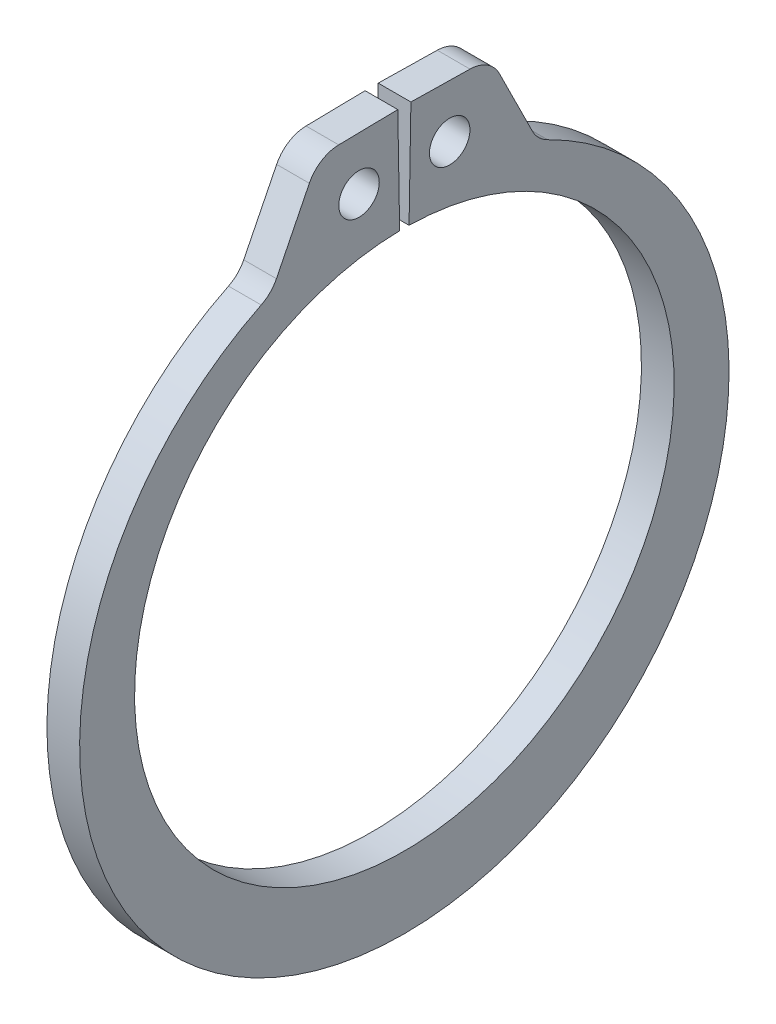
ISO-10303-21;
HEADER;
FILE_DESCRIPTION(('STEP AP214'),'2;1');
FILE_NAME('part.step','',(''),(''),'','','');
FILE_SCHEMA(('AUTOMOTIVE_DESIGN { 1 0 10303 214 1 1 1 1 }'));
ENDSEC;
DATA;
#1=APPLICATION_CONTEXT('core data for automotive mechanical design processes');
#2=APPLICATION_PROTOCOL_DEFINITION('international standard','automotive_design',2000,#1);
#3=PRODUCT_CONTEXT('',#1,'mechanical');
#4=PRODUCT('Part','Part','',(#3));
#5=PRODUCT_RELATED_PRODUCT_CATEGORY('part','',(#4));
#6=PRODUCT_DEFINITION_FORMATION('','',#4);
#7=PRODUCT_DEFINITION_CONTEXT('part definition',#1,'design');
#8=PRODUCT_DEFINITION('design','',#6,#7);
#9=PRODUCT_DEFINITION_SHAPE('','',#8);
#10=(LENGTH_UNIT() NAMED_UNIT(*) SI_UNIT(.MILLI.,.METRE.));
#11=(NAMED_UNIT(*) PLANE_ANGLE_UNIT() SI_UNIT($,.RADIAN.));
#12=(NAMED_UNIT(*) SI_UNIT($,.STERADIAN.) SOLID_ANGLE_UNIT());
#13=UNCERTAINTY_MEASURE_WITH_UNIT(LENGTH_MEASURE(1.E-05),#10,'distance_accuracy_value','');
#14=(GEOMETRIC_REPRESENTATION_CONTEXT(3) GLOBAL_UNCERTAINTY_ASSIGNED_CONTEXT((#13)) GLOBAL_UNIT_ASSIGNED_CONTEXT((#10,
#11,#12)) REPRESENTATION_CONTEXT('',''));
#15=CARTESIAN_POINT('',(0.,0.,0.));
#16=DIRECTION('',(0.,0.,1.));
#17=DIRECTION('',(1.,0.,0.));
#18=AXIS2_PLACEMENT_3D('',#15,#16,#17);
#19=CARTESIAN_POINT('',(0.5334,0.,0.));
#20=DIRECTION('',(1.,0.,0.));
#21=DIRECTION('',(0.,0.,-1.));
#22=AXIS2_PLACEMENT_3D('',#19,#20,#21);
#23=PLANE('',#22);
#24=CARTESIAN_POINT('',(0.5334,10.5040886416162,1.47894687499926));
#25=DIRECTION('',(1.,0.,0.));
#26=DIRECTION('',(0.,0.,-1.));
#27=AXIS2_PLACEMENT_3D('',#24,#25,#26);
#28=CIRCLE('',#27,0.6604);
#29=CARTESIAN_POINT('',(0.5334,10.5040886416162,0.818546874999264));
#30=VERTEX_POINT('',#29);
#31=EDGE_CURVE('E153',#30,#30,#28,.T.);
#32=ORIENTED_EDGE('',*,*,#31,.F.);
#33=EDGE_LOOP('',(#32));
#34=FACE_BOUND('',#33,.T.);
#35=DIRECTION('',(0.,-0.0174524064372888,0.999847695156391));
#36=VECTOR('',#35,1.);
#37=CARTESIAN_POINT('',(0.5334,12.2536334279892,0.213887967092128));
#38=LINE('',#37,#36);
#39=CARTESIAN_POINT('',(0.5334,12.2536334279892,0.213887967092128));
#40=VERTEX_POINT('',#39);
#41=CARTESIAN_POINT('',(0.5334,12.21999978275,2.14075821234739));
#42=VERTEX_POINT('',#41);
#43=EDGE_CURVE('E177',#40,#42,#38,.T.);
#44=ORIENTED_EDGE('',*,*,#43,.T.);
#45=CARTESIAN_POINT('',(0.5334,11.1279661301002,2.12169669403658));
#46=DIRECTION('',(1.,0.,0.));
#47=DIRECTION('',(0.,0.,-1.));
#48=AXIS2_PLACEMENT_3D('',#45,#46,#47);
#49=CIRCLE('',#48,1.0922);
#50=CARTESIAN_POINT('',(0.5334,11.6141614114107,3.09971253666458));
#51=VERTEX_POINT('',#50);
#52=EDGE_CURVE('E216',#42,#51,#49,.T.);
#53=ORIENTED_EDGE('',*,*,#52,.T.);
#54=DIRECTION('',(0.,-0.895454900776411,0.445152244378829));
#55=VECTOR('',#54,1.);
#56=CARTESIAN_POINT('',(0.5334,12.2084177333914,2.80429337570331));
#57=LINE('',#56,#55);
#58=CARTESIAN_POINT('',(0.5334,9.45539137797144,4.17288922557434));
#59=VERTEX_POINT('',#58);
#60=EDGE_CURVE('E179',#51,#59,#57,.T.);
#61=ORIENTED_EDGE('',*,*,#60,.T.);
#62=CARTESIAN_POINT('',(0.5334,9.941586659282,5.15090506820234));
#63=DIRECTION('',(1.,0.,0.));
#64=DIRECTION('',(0.,0.,-1.));
#65=AXIS2_PLACEMENT_3D('',#62,#63,#64);
#66=CIRCLE('',#65,1.0922);
#67=CARTESIAN_POINT('',(0.5334,8.96124610534802,4.66941442622431));
#68=VERTEX_POINT('',#67);
#69=EDGE_CURVE('E223',#59,#68,#66,.F.);
#70=ORIENTED_EDGE('',*,*,#69,.T.);
#71=CARTESIAN_POINT('',(0.5334,-0.545929997486655,0.));
#72=DIRECTION('',(1.,0.,0.));
#73=DIRECTION('',(0.,0.,-1.));
#74=AXIS2_PLACEMENT_3D('',#71,#72,#73);
#75=CIRCLE('',#74,10.5919700025133);
#76=CARTESIAN_POINT('',(0.5334,8.96124610534802,-4.66941442622431));
#77=VERTEX_POINT('',#76);
#78=EDGE_CURVE('E182',#68,#77,#75,.T.);
#79=ORIENTED_EDGE('',*,*,#78,.T.);
#80=CARTESIAN_POINT('',(0.5334,9.941586659282,-5.15090506820234));
#81=DIRECTION('',(1.,0.,0.));
#82=DIRECTION('',(0.,0.,-1.));
#83=AXIS2_PLACEMENT_3D('',#80,#81,#82);
#84=CIRCLE('',#83,1.0922);
#85=CARTESIAN_POINT('',(0.5334,9.45539137797144,-4.17288922557434));
#86=VERTEX_POINT('',#85);
#87=EDGE_CURVE('E11',#77,#86,#84,.F.);
#88=ORIENTED_EDGE('',*,*,#87,.T.);
#89=DIRECTION('',(0.,0.895454900776411,0.445152244378829));
#90=VECTOR('',#89,1.);
#91=CARTESIAN_POINT('',(0.5334,12.2084177333914,-2.80429337570331));
#92=LINE('',#91,#90);
#93=CARTESIAN_POINT('',(0.5334,11.6141614114107,-3.09971253666458));
#94=VERTEX_POINT('',#93);
#95=EDGE_CURVE('E185',#86,#94,#92,.T.);
#96=ORIENTED_EDGE('',*,*,#95,.T.);
#97=CARTESIAN_POINT('',(0.5334,11.1279661301002,-2.12169669403658));
#98=DIRECTION('',(1.,0.,0.));
#99=DIRECTION('',(0.,0.,-1.));
#100=AXIS2_PLACEMENT_3D('',#97,#98,#99);
#101=CIRCLE('',#100,1.0922);
#102=CARTESIAN_POINT('',(0.5334,12.21999978275,-2.14075821234739));
#103=VERTEX_POINT('',#102);
#104=EDGE_CURVE('E51',#94,#103,#101,.T.);
#105=ORIENTED_EDGE('',*,*,#104,.T.);
#106=DIRECTION('',(0.,0.0174524064372888,0.999847695156391));
#107=VECTOR('',#106,1.);
#108=CARTESIAN_POINT('',(0.5334,12.2536334279892,-0.213887967092128));
#109=LINE('',#108,#107);
#110=CARTESIAN_POINT('',(0.5334,12.2536334279892,-0.213887967092128));
#111=VERTEX_POINT('',#110);
#112=EDGE_CURVE('E187',#103,#111,#109,.T.);
#113=ORIENTED_EDGE('',*,*,#112,.T.);
#114=DIRECTION('',(0.,-0.999847695156391,0.0174524064372835));
#115=VECTOR('',#114,1.);
#116=CARTESIAN_POINT('',(0.5334,8.79975954984091,-0.153600374295176));
#117=LINE('',#116,#115);
#118=CARTESIAN_POINT('',(0.5334,8.79975954984091,-0.153600374295176));
#119=VERTEX_POINT('',#118);
#120=EDGE_CURVE('E189',#111,#119,#117,.T.);
#121=ORIENTED_EDGE('',*,*,#120,.T.);
#122=CARTESIAN_POINT('',(0.5334,0.,0.));
#123=DIRECTION('',(-1.,0.,0.));
#124=DIRECTION('',(0.,0.,-1.));
#125=AXIS2_PLACEMENT_3D('',#122,#123,#124);
#126=CIRCLE('',#125,8.8011);
#127=CARTESIAN_POINT('',(0.5334,8.79975954984091,0.153600374295176));
#128=VERTEX_POINT('',#127);
#129=EDGE_CURVE('E174',#119,#128,#126,.T.);
#130=ORIENTED_EDGE('',*,*,#129,.T.);
#131=DIRECTION('',(0.,0.999847695156391,0.0174524064372835));
#132=VECTOR('',#131,1.);
#133=CARTESIAN_POINT('',(0.5334,8.79975954984091,0.153600374295176));
#134=LINE('',#133,#132);
#135=EDGE_CURVE('E143',#128,#40,#134,.T.);
#136=ORIENTED_EDGE('',*,*,#135,.T.);
#137=EDGE_LOOP('',(#44,#53,#61,#70,#79,#88,#96,#105,#113,#121,#130,#136));
#138=FACE_BOUND('',#137,.T.);
#139=CARTESIAN_POINT('',(0.5334,10.5040886416162,-1.47894687499926));
#140=DIRECTION('',(1.,0.,0.));
#141=DIRECTION('',(0.,0.,-1.));
#142=AXIS2_PLACEMENT_3D('',#139,#140,#141);
#143=CIRCLE('',#142,0.6604);
#144=CARTESIAN_POINT('',(0.5334,10.5040886416162,-2.13934687499926));
#145=VERTEX_POINT('',#144);
#146=EDGE_CURVE('E398',#145,#145,#143,.T.);
#147=ORIENTED_EDGE('',*,*,#146,.F.);
#148=EDGE_LOOP('',(#147));
#149=FACE_BOUND('',#148,.T.);
#150=ADVANCED_FACE('F36',(#34,#138,#149),#23,.T.);
#151=CARTESIAN_POINT('',(-0.5334,0.,0.));
#152=DIRECTION('',(1.,0.,0.));
#153=DIRECTION('',(0.,0.,-1.));
#154=AXIS2_PLACEMENT_3D('',#151,#152,#153);
#155=PLANE('',#154);
#156=CARTESIAN_POINT('',(-0.5334,10.5040886416162,1.47894687499926));
#157=DIRECTION('',(1.,0.,0.));
#158=DIRECTION('',(0.,0.,-1.));
#159=AXIS2_PLACEMENT_3D('',#156,#157,#158);
#160=CIRCLE('',#159,0.6604);
#161=CARTESIAN_POINT('',(-0.5334,10.5040886416162,0.818546874999264));
#162=VERTEX_POINT('',#161);
#163=EDGE_CURVE('E156',#162,#162,#160,.T.);
#164=ORIENTED_EDGE('',*,*,#163,.T.);
#165=EDGE_LOOP('',(#164));
#166=FACE_BOUND('',#165,.T.);
#167=DIRECTION('',(0.,-0.895454900776411,0.445152244378829));
#168=VECTOR('',#167,1.);
#169=CARTESIAN_POINT('',(-0.533400000000003,12.2084177333914,2.80429337570331));
#170=LINE('',#169,#168);
#171=CARTESIAN_POINT('',(-0.5334,11.6141614114107,3.09971253666458));
#172=VERTEX_POINT('',#171);
#173=CARTESIAN_POINT('',(-0.5334,9.45539137797144,4.17288922557434));
#174=VERTEX_POINT('',#173);
#175=EDGE_CURVE('E161',#172,#174,#170,.T.);
#176=ORIENTED_EDGE('',*,*,#175,.F.);
#177=CARTESIAN_POINT('',(-0.5334,11.1279661301002,2.12169669403658));
#178=DIRECTION('',(1.,0.,0.));
#179=DIRECTION('',(0.,0.,-1.));
#180=AXIS2_PLACEMENT_3D('',#177,#178,#179);
#181=CIRCLE('',#180,1.0922);
#182=CARTESIAN_POINT('',(-0.533400000000003,12.21999978275,2.14075821234739));
#183=VERTEX_POINT('',#182);
#184=EDGE_CURVE('E212',#172,#183,#181,.F.);
#185=ORIENTED_EDGE('',*,*,#184,.T.);
#186=DIRECTION('',(0.,-0.0174524064372888,0.999847695156391));
#187=VECTOR('',#186,1.);
#188=CARTESIAN_POINT('',(-0.533400000000003,12.2536334279892,0.213887967092128));
#189=LINE('',#188,#187);
#190=CARTESIAN_POINT('',(-0.533400000000003,12.2536334279892,0.213887967092128));
#191=VERTEX_POINT('',#190);
#192=EDGE_CURVE('E135',#191,#183,#189,.T.);
#193=ORIENTED_EDGE('',*,*,#192,.F.);
#194=DIRECTION('',(0.,0.999847695156391,0.0174524064372835));
#195=VECTOR('',#194,1.);
#196=CARTESIAN_POINT('',(-0.5334,8.79975954984091,0.153600374295176));
#197=LINE('',#196,#195);
#198=CARTESIAN_POINT('',(-0.5334,8.79975954984091,0.153600374295176));
#199=VERTEX_POINT('',#198);
#200=EDGE_CURVE('E127',#199,#191,#197,.T.);
#201=ORIENTED_EDGE('',*,*,#200,.F.);
#202=CARTESIAN_POINT('',(-0.5334,0.,0.));
#203=DIRECTION('',(-1.,0.,0.));
#204=DIRECTION('',(0.,0.,-1.));
#205=AXIS2_PLACEMENT_3D('',#202,#203,#204);
#206=CIRCLE('',#205,8.8011);
#207=CARTESIAN_POINT('',(-0.5334,8.79975954984091,-0.153600374295176));
#208=VERTEX_POINT('',#207);
#209=EDGE_CURVE('E134',#208,#199,#206,.T.);
#210=ORIENTED_EDGE('',*,*,#209,.F.);
#211=DIRECTION('',(0.,-0.999847695156391,0.0174524064372835));
#212=VECTOR('',#211,1.);
#213=CARTESIAN_POINT('',(-0.5334,8.79975954984091,-0.153600374295176));
#214=LINE('',#213,#212);
#215=CARTESIAN_POINT('',(-0.533400000000003,12.2536334279892,-0.213887967092128));
#216=VERTEX_POINT('',#215);
#217=EDGE_CURVE('E172',#216,#208,#214,.T.);
#218=ORIENTED_EDGE('',*,*,#217,.F.);
#219=DIRECTION('',(0.,0.0174524064372888,0.999847695156391));
#220=VECTOR('',#219,1.);
#221=CARTESIAN_POINT('',(-0.533400000000003,12.2536334279892,-0.213887967092128));
#222=LINE('',#221,#220);
#223=CARTESIAN_POINT('',(-0.533400000000003,12.21999978275,-2.14075821234739));
#224=VERTEX_POINT('',#223);
#225=EDGE_CURVE('E170',#224,#216,#222,.T.);
#226=ORIENTED_EDGE('',*,*,#225,.F.);
#227=CARTESIAN_POINT('',(-0.5334,11.1279661301002,-2.12169669403658));
#228=DIRECTION('',(1.,0.,0.));
#229=DIRECTION('',(0.,0.,-1.));
#230=AXIS2_PLACEMENT_3D('',#227,#228,#229);
#231=CIRCLE('',#230,1.0922);
#232=CARTESIAN_POINT('',(-0.5334,11.6141614114107,-3.09971253666458));
#233=VERTEX_POINT('',#232);
#234=EDGE_CURVE('E210',#224,#233,#231,.F.);
#235=ORIENTED_EDGE('',*,*,#234,.T.);
#236=DIRECTION('',(0.,0.895454900776411,0.445152244378829));
#237=VECTOR('',#236,1.);
#238=CARTESIAN_POINT('',(-0.533400000000003,12.2084177333914,-2.80429337570331));
#239=LINE('',#238,#237);
#240=CARTESIAN_POINT('',(-0.5334,9.45539137797144,-4.17288922557434));
#241=VERTEX_POINT('',#240);
#242=EDGE_CURVE('E167',#241,#233,#239,.T.);
#243=ORIENTED_EDGE('',*,*,#242,.F.);
#244=CARTESIAN_POINT('',(-0.5334,9.941586659282,-5.15090506820234));
#245=DIRECTION('',(1.,0.,0.));
#246=DIRECTION('',(0.,0.,-1.));
#247=AXIS2_PLACEMENT_3D('',#244,#245,#246);
#248=CIRCLE('',#247,1.0922);
#249=CARTESIAN_POINT('',(-0.5334,8.96124610534802,-4.66941442622431));
#250=VERTEX_POINT('',#249);
#251=EDGE_CURVE('E44',#241,#250,#248,.T.);
#252=ORIENTED_EDGE('',*,*,#251,.T.);
#253=CARTESIAN_POINT('',(-0.5334,-0.545929997486655,0.));
#254=DIRECTION('',(1.,0.,0.));
#255=DIRECTION('',(0.,0.,-1.));
#256=AXIS2_PLACEMENT_3D('',#253,#254,#255);
#257=CIRCLE('',#256,10.5919700025133);
#258=CARTESIAN_POINT('',(-0.5334,8.96124610534802,4.66941442622431));
#259=VERTEX_POINT('',#258);
#260=EDGE_CURVE('E164',#259,#250,#257,.T.);
#261=ORIENTED_EDGE('',*,*,#260,.F.);
#262=CARTESIAN_POINT('',(-0.5334,9.941586659282,5.15090506820234));
#263=DIRECTION('',(1.,0.,0.));
#264=DIRECTION('',(0.,0.,-1.));
#265=AXIS2_PLACEMENT_3D('',#262,#263,#264);
#266=CIRCLE('',#265,1.0922);
#267=EDGE_CURVE('E221',#259,#174,#266,.T.);
#268=ORIENTED_EDGE('',*,*,#267,.T.);
#269=EDGE_LOOP('',(#176,#185,#193,#201,#210,#218,#226,#235,#243,#252,#261,#268));
#270=FACE_BOUND('',#269,.T.);
#271=CARTESIAN_POINT('',(-0.5334,10.5040886416162,-1.47894687499926));
#272=DIRECTION('',(1.,0.,0.));
#273=DIRECTION('',(0.,0.,-1.));
#274=AXIS2_PLACEMENT_3D('',#271,#272,#273);
#275=CIRCLE('',#274,0.6604);
#276=CARTESIAN_POINT('',(-0.5334,10.5040886416162,-2.13934687499926));
#277=VERTEX_POINT('',#276);
#278=EDGE_CURVE('E401',#277,#277,#275,.T.);
#279=ORIENTED_EDGE('',*,*,#278,.T.);
#280=EDGE_LOOP('',(#279));
#281=FACE_BOUND('',#280,.T.);
#282=ADVANCED_FACE('F130',(#166,#270,#281),#155,.F.);
#283=CARTESIAN_POINT('',(0.5334,0.,0.));
#284=DIRECTION('',(-1.,0.,0.));
#285=DIRECTION('',(0.,0.,1.));
#286=AXIS2_PLACEMENT_3D('',#283,#284,#285);
#287=CYLINDRICAL_SURFACE('',#286,8.8011);
#288=ORIENTED_EDGE('',*,*,#209,.T.);
#289=DIRECTION('',(-1.,0.,0.));
#290=VECTOR('',#289,1.);
#291=CARTESIAN_POINT('',(0.5334,8.79975954984091,0.153600374295176));
#292=LINE('',#291,#290);
#293=EDGE_CURVE('E141',#128,#199,#292,.T.);
#294=ORIENTED_EDGE('',*,*,#293,.F.);
#295=ORIENTED_EDGE('',*,*,#129,.F.);
#296=DIRECTION('',(-1.,0.,0.));
#297=VECTOR('',#296,1.);
#298=CARTESIAN_POINT('',(0.5334,8.79975954984091,-0.153600374295176));
#299=LINE('',#298,#297);
#300=EDGE_CURVE('E152',#119,#208,#299,.T.);
#301=ORIENTED_EDGE('',*,*,#300,.T.);
#302=EDGE_LOOP('',(#288,#294,#295,#301));
#303=FACE_BOUND('',#302,.T.);
#304=ADVANCED_FACE('F38',(#303),#287,.F.);
#305=CARTESIAN_POINT('',(0.5334,8.79975954984091,0.153600374295176));
#306=DIRECTION('',(0.,-0.0174524064372835,0.999847695156391));
#307=DIRECTION('',(0.,-0.999847695156391,-0.0174524064372835));
#308=AXIS2_PLACEMENT_3D('',#305,#306,#307);
#309=PLANE('',#308);
#310=ORIENTED_EDGE('',*,*,#200,.T.);
#311=DIRECTION('',(-1.,0.,0.));
#312=VECTOR('',#311,1.);
#313=CARTESIAN_POINT('',(0.5334,12.2536334279892,0.213887967092128));
#314=LINE('',#313,#312);
#315=EDGE_CURVE('E148',#40,#191,#314,.T.);
#316=ORIENTED_EDGE('',*,*,#315,.F.);
#317=ORIENTED_EDGE('',*,*,#135,.F.);
#318=ORIENTED_EDGE('',*,*,#293,.T.);
#319=EDGE_LOOP('',(#310,#316,#317,#318));
#320=FACE_BOUND('',#319,.T.);
#321=ADVANCED_FACE('F142',(#320),#309,.F.);
#322=CARTESIAN_POINT('',(0.5334,12.2536334279892,0.213887967092128));
#323=DIRECTION('',(0.,-0.999847695156391,-0.0174524064372888));
#324=DIRECTION('',(0.,0.0174524064372888,-0.999847695156391));
#325=AXIS2_PLACEMENT_3D('',#322,#323,#324);
#326=PLANE('',#325);
#327=ORIENTED_EDGE('',*,*,#192,.T.);
#328=DIRECTION('',(-1.,0.,0.));
#329=VECTOR('',#328,1.);
#330=CARTESIAN_POINT('',(0.5334,12.21999978275,2.14075821234739));
#331=LINE('',#330,#329);
#332=EDGE_CURVE('E59',#183,#42,#331,.F.);
#333=ORIENTED_EDGE('',*,*,#332,.T.);
#334=ORIENTED_EDGE('',*,*,#43,.F.);
#335=ORIENTED_EDGE('',*,*,#315,.T.);
#336=EDGE_LOOP('',(#327,#333,#334,#335));
#337=FACE_BOUND('',#336,.T.);
#338=ADVANCED_FACE('F251',(#337),#326,.F.);
#339=CARTESIAN_POINT('',(0.5334,12.2084177333914,2.80429337570331));
#340=DIRECTION('',(0.,-0.445152244378829,-0.895454900776411));
#341=DIRECTION('',(0.,0.895454900776411,-0.445152244378829));
#342=AXIS2_PLACEMENT_3D('',#339,#340,#341);
#343=PLANE('',#342);
#344=ORIENTED_EDGE('',*,*,#175,.T.);
#345=DIRECTION('',(1.,0.,0.));
#346=VECTOR('',#345,1.);
#347=CARTESIAN_POINT('',(0.5334,9.45539137797144,4.17288922557434));
#348=LINE('',#347,#346);
#349=EDGE_CURVE('E203',#174,#59,#348,.T.);
#350=ORIENTED_EDGE('',*,*,#349,.T.);
#351=ORIENTED_EDGE('',*,*,#60,.F.);
#352=DIRECTION('',(-1.,0.,0.));
#353=VECTOR('',#352,1.);
#354=CARTESIAN_POINT('',(0.5334,11.6141614114107,3.09971253666458));
#355=LINE('',#354,#353);
#356=EDGE_CURVE('E200',#51,#172,#355,.T.);
#357=ORIENTED_EDGE('',*,*,#356,.T.);
#358=EDGE_LOOP('',(#344,#350,#351,#357));
#359=FACE_BOUND('',#358,.T.);
#360=ADVANCED_FACE('F253',(#359),#343,.F.);
#361=CARTESIAN_POINT('',(0.5334,-0.545929997486655,0.));
#362=DIRECTION('',(-1.,0.,0.));
#363=DIRECTION('',(0.,0.,1.));
#364=AXIS2_PLACEMENT_3D('',#361,#362,#363);
#365=CYLINDRICAL_SURFACE('',#364,10.5919700025133);
#366=ORIENTED_EDGE('',*,*,#78,.F.);
#367=DIRECTION('',(-1.,0.,0.));
#368=VECTOR('',#367,1.);
#369=CARTESIAN_POINT('',(0.5334,8.96124610534802,4.66941442622431));
#370=LINE('',#369,#368);
#371=EDGE_CURVE('E197',#68,#259,#370,.T.);
#372=ORIENTED_EDGE('',*,*,#371,.T.);
#373=ORIENTED_EDGE('',*,*,#260,.T.);
#374=DIRECTION('',(-1.,0.,0.));
#375=VECTOR('',#374,1.);
#376=CARTESIAN_POINT('',(0.5334,8.96124610534802,-4.66941442622431));
#377=LINE('',#376,#375);
#378=EDGE_CURVE('E147',#250,#77,#377,.F.);
#379=ORIENTED_EDGE('',*,*,#378,.T.);
#380=EDGE_LOOP('',(#366,#372,#373,#379));
#381=FACE_BOUND('',#380,.T.);
#382=ADVANCED_FACE('F231',(#381),#365,.T.);
#383=CARTESIAN_POINT('',(0.5334,12.2084177333914,-2.80429337570331));
#384=DIRECTION('',(0.,-0.445152244378829,0.895454900776411));
#385=DIRECTION('',(0.,-0.895454900776411,-0.445152244378829));
#386=AXIS2_PLACEMENT_3D('',#383,#384,#385);
#387=PLANE('',#386);
#388=ORIENTED_EDGE('',*,*,#95,.F.);
#389=DIRECTION('',(1.,0.,0.));
#390=VECTOR('',#389,1.);
#391=CARTESIAN_POINT('',(-0.5334,9.45539137797144,-4.17288922557434));
#392=LINE('',#391,#390);
#393=EDGE_CURVE('E207',#86,#241,#392,.F.);
#394=ORIENTED_EDGE('',*,*,#393,.T.);
#395=ORIENTED_EDGE('',*,*,#242,.T.);
#396=DIRECTION('',(-1.,0.,0.));
#397=VECTOR('',#396,1.);
#398=CARTESIAN_POINT('',(0.5334,11.6141614114107,-3.09971253666458));
#399=LINE('',#398,#397);
#400=EDGE_CURVE('E205',#233,#94,#399,.F.);
#401=ORIENTED_EDGE('',*,*,#400,.T.);
#402=EDGE_LOOP('',(#388,#394,#395,#401));
#403=FACE_BOUND('',#402,.T.);
#404=ADVANCED_FACE('F238',(#403),#387,.F.);
#405=CARTESIAN_POINT('',(0.5334,12.2536334279892,-0.213887967092128));
#406=DIRECTION('',(0.,-0.999847695156391,0.0174524064372888));
#407=DIRECTION('',(0.,-0.0174524064372888,-0.999847695156391));
#408=AXIS2_PLACEMENT_3D('',#405,#406,#407);
#409=PLANE('',#408);
#410=ORIENTED_EDGE('',*,*,#112,.F.);
#411=DIRECTION('',(-1.,0.,0.));
#412=VECTOR('',#411,1.);
#413=CARTESIAN_POINT('',(0.5334,12.21999978275,-2.14075821234739));
#414=LINE('',#413,#412);
#415=EDGE_CURVE('E218',#103,#224,#414,.T.);
#416=ORIENTED_EDGE('',*,*,#415,.T.);
#417=ORIENTED_EDGE('',*,*,#225,.T.);
#418=DIRECTION('',(-1.,0.,0.));
#419=VECTOR('',#418,1.);
#420=CARTESIAN_POINT('',(0.5334,12.2536334279892,-0.213887967092128));
#421=LINE('',#420,#419);
#422=EDGE_CURVE('E192',#111,#216,#421,.T.);
#423=ORIENTED_EDGE('',*,*,#422,.F.);
#424=EDGE_LOOP('',(#410,#416,#417,#423));
#425=FACE_BOUND('',#424,.T.);
#426=ADVANCED_FACE('F245',(#425),#409,.F.);
#427=CARTESIAN_POINT('',(0.5334,8.79975954984091,-0.153600374295176));
#428=DIRECTION('',(0.,-0.0174524064372835,-0.999847695156391));
#429=DIRECTION('',(0.,0.999847695156391,-0.0174524064372835));
#430=AXIS2_PLACEMENT_3D('',#427,#428,#429);
#431=PLANE('',#430);
#432=ORIENTED_EDGE('',*,*,#217,.T.);
#433=ORIENTED_EDGE('',*,*,#300,.F.);
#434=ORIENTED_EDGE('',*,*,#120,.F.);
#435=ORIENTED_EDGE('',*,*,#422,.T.);
#436=EDGE_LOOP('',(#432,#433,#434,#435));
#437=FACE_BOUND('',#436,.T.);
#438=ADVANCED_FACE('F248',(#437),#431,.F.);
#439=CARTESIAN_POINT('',(0.5334,10.5040886416162,1.47894687499926));
#440=DIRECTION('',(-1.,0.,0.));
#441=DIRECTION('',(0.,0.,1.));
#442=AXIS2_PLACEMENT_3D('',#439,#440,#441);
#443=CYLINDRICAL_SURFACE('',#442,0.6604);
#444=ORIENTED_EDGE('',*,*,#31,.T.);
#445=EDGE_LOOP('',(#444));
#446=FACE_BOUND('',#445,.T.);
#447=ORIENTED_EDGE('',*,*,#163,.F.);
#448=EDGE_LOOP('',(#447));
#449=FACE_BOUND('',#448,.T.);
#450=ADVANCED_FACE('F274',(#446,#449),#443,.F.);
#451=CARTESIAN_POINT('',(0.5334,10.5040886416162,-1.47894687499926));
#452=DIRECTION('',(-1.,0.,0.));
#453=DIRECTION('',(0.,0.,1.));
#454=AXIS2_PLACEMENT_3D('',#451,#452,#453);
#455=CYLINDRICAL_SURFACE('',#454,0.6604);
#456=ORIENTED_EDGE('',*,*,#146,.T.);
#457=EDGE_LOOP('',(#456));
#458=FACE_BOUND('',#457,.T.);
#459=ORIENTED_EDGE('',*,*,#278,.F.);
#460=EDGE_LOOP('',(#459));
#461=FACE_BOUND('',#460,.T.);
#462=ADVANCED_FACE('F302',(#458,#461),#455,.F.);
#463=CARTESIAN_POINT('',(0.5334,9.941586659282,5.15090506820234));
#464=DIRECTION('',(-1.,0.,0.));
#465=DIRECTION('',(0.,0.,1.));
#466=AXIS2_PLACEMENT_3D('',#463,#464,#465);
#467=CYLINDRICAL_SURFACE('',#466,1.0922);
#468=ORIENTED_EDGE('',*,*,#69,.F.);
#469=ORIENTED_EDGE('',*,*,#349,.F.);
#470=ORIENTED_EDGE('',*,*,#267,.F.);
#471=ORIENTED_EDGE('',*,*,#371,.F.);
#472=EDGE_LOOP('',(#468,#469,#470,#471));
#473=FACE_BOUND('',#472,.T.);
#474=ADVANCED_FACE('F309',(#473),#467,.F.);
#475=CARTESIAN_POINT('',(0.5334,9.941586659282,-5.15090506820234));
#476=DIRECTION('',(-1.,0.,0.));
#477=DIRECTION('',(0.,0.,1.));
#478=AXIS2_PLACEMENT_3D('',#475,#476,#477);
#479=CYLINDRICAL_SURFACE('',#478,1.0922);
#480=ORIENTED_EDGE('',*,*,#87,.F.);
#481=ORIENTED_EDGE('',*,*,#378,.F.);
#482=ORIENTED_EDGE('',*,*,#251,.F.);
#483=ORIENTED_EDGE('',*,*,#393,.F.);
#484=EDGE_LOOP('',(#480,#481,#482,#483));
#485=FACE_BOUND('',#484,.T.);
#486=ADVANCED_FACE('F234',(#485),#479,.F.);
#487=CARTESIAN_POINT('',(0.5334,11.1279661301002,2.12169669403658));
#488=DIRECTION('',(-1.,0.,0.));
#489=DIRECTION('',(0.,0.,1.));
#490=AXIS2_PLACEMENT_3D('',#487,#488,#489);
#491=CYLINDRICAL_SURFACE('',#490,1.0922);
#492=ORIENTED_EDGE('',*,*,#52,.F.);
#493=ORIENTED_EDGE('',*,*,#332,.F.);
#494=ORIENTED_EDGE('',*,*,#184,.F.);
#495=ORIENTED_EDGE('',*,*,#356,.F.);
#496=EDGE_LOOP('',(#492,#493,#494,#495));
#497=FACE_BOUND('',#496,.T.);
#498=ADVANCED_FACE('F324',(#497),#491,.T.);
#499=CARTESIAN_POINT('',(0.5334,11.1279661301002,-2.12169669403658));
#500=DIRECTION('',(-1.,0.,0.));
#501=DIRECTION('',(0.,0.,1.));
#502=AXIS2_PLACEMENT_3D('',#499,#500,#501);
#503=CYLINDRICAL_SURFACE('',#502,1.0922);
#504=ORIENTED_EDGE('',*,*,#104,.F.);
#505=ORIENTED_EDGE('',*,*,#400,.F.);
#506=ORIENTED_EDGE('',*,*,#234,.F.);
#507=ORIENTED_EDGE('',*,*,#415,.F.);
#508=EDGE_LOOP('',(#504,#505,#506,#507));
#509=FACE_BOUND('',#508,.T.);
#510=ADVANCED_FACE('F241',(#509),#503,.T.);
#511=CLOSED_SHELL('',(#150,#282,#304,#321,#338,#360,#382,#404,#426,#438,#450,#462,#474,#486,
#498,#510));
#512=MANIFOLD_SOLID_BREP('B2',#511);
#513=ADVANCED_BREP_SHAPE_REPRESENTATION('',(#18,#512),#14);
#514=SHAPE_DEFINITION_REPRESENTATION(#9,#513);
ENDSEC;
END-ISO-10303-21;
